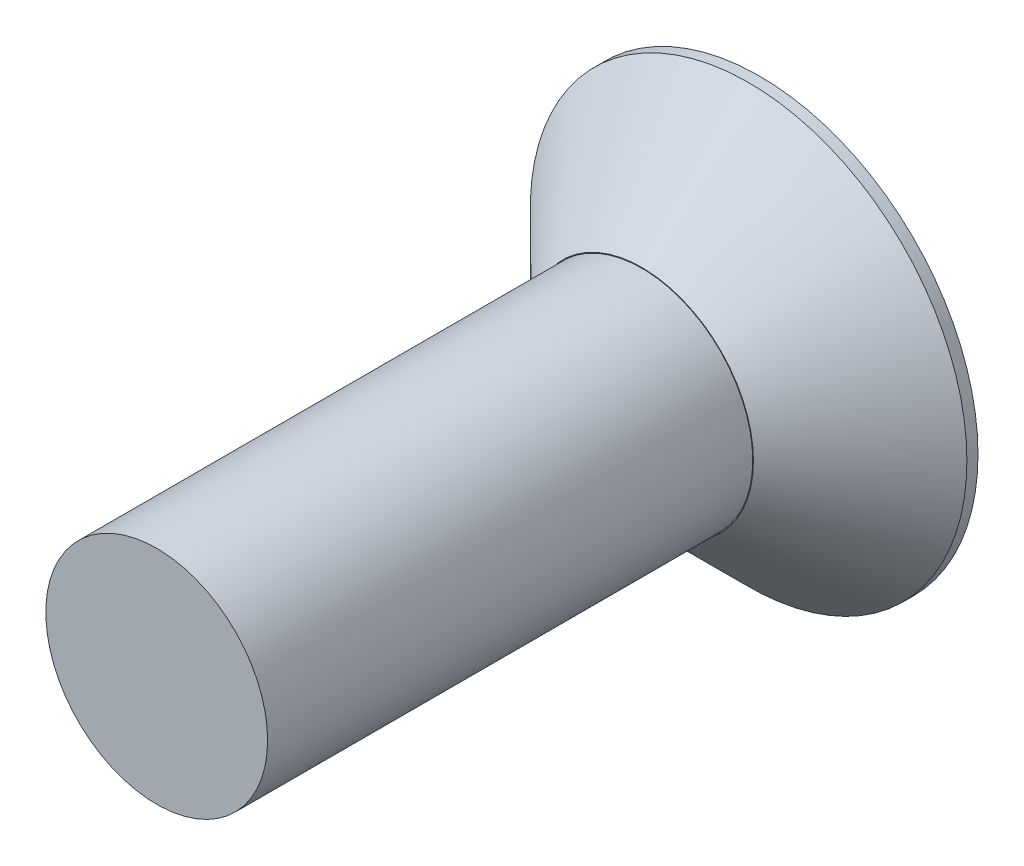
ISO-10303-21;
HEADER;
FILE_DESCRIPTION(('STEP AP214'),'2;1');
FILE_NAME('part.step','',(''),(''),'','','');
FILE_SCHEMA(('AUTOMOTIVE_DESIGN { 1 0 10303 214 1 1 1 1 }'));
ENDSEC;
DATA;
#1=APPLICATION_CONTEXT('core data for automotive mechanical design processes');
#2=APPLICATION_PROTOCOL_DEFINITION('international standard','automotive_design',2000,#1);
#3=PRODUCT_CONTEXT('',#1,'mechanical');
#4=PRODUCT('Part','Part','',(#3));
#5=PRODUCT_RELATED_PRODUCT_CATEGORY('part','',(#4));
#6=PRODUCT_DEFINITION_FORMATION('','',#4);
#7=PRODUCT_DEFINITION_CONTEXT('part definition',#1,'design');
#8=PRODUCT_DEFINITION('design','',#6,#7);
#9=PRODUCT_DEFINITION_SHAPE('','',#8);
#10=(LENGTH_UNIT() NAMED_UNIT(*) SI_UNIT(.MILLI.,.METRE.));
#11=(NAMED_UNIT(*) PLANE_ANGLE_UNIT() SI_UNIT($,.RADIAN.));
#12=(NAMED_UNIT(*) SI_UNIT($,.STERADIAN.) SOLID_ANGLE_UNIT());
#13=UNCERTAINTY_MEASURE_WITH_UNIT(LENGTH_MEASURE(1.E-05),#10,'distance_accuracy_value','');
#14=(GEOMETRIC_REPRESENTATION_CONTEXT(3) GLOBAL_UNCERTAINTY_ASSIGNED_CONTEXT((#13)) GLOBAL_UNIT_ASSIGNED_CONTEXT((#10,
#11,#12)) REPRESENTATION_CONTEXT('',''));
#15=CARTESIAN_POINT('',(0.,0.,0.));
#16=DIRECTION('',(0.,0.,1.));
#17=DIRECTION('',(1.,0.,0.));
#18=AXIS2_PLACEMENT_3D('',#15,#16,#17);
#19=CARTESIAN_POINT('',(-2.54,0.254,1.016));
#20=DIRECTION('',(0.,1.,0.));
#21=DIRECTION('',(-1.,0.,0.));
#22=AXIS2_PLACEMENT_3D('',#19,#20,#21);
#23=PLANE('',#22);
#24=DIRECTION('',(1.,0.,0.));
#25=VECTOR('',#24,1.);
#26=CARTESIAN_POINT('',(-2.54,0.254,1.016));
#27=LINE('',#26,#25);
#28=CARTESIAN_POINT('',(0.254,0.254,1.016));
#29=VERTEX_POINT('',#28);
#30=CARTESIAN_POINT('',(2.54,0.254,1.016));
#31=VERTEX_POINT('',#30);
#32=EDGE_CURVE('E188',#29,#31,#27,.T.);
#33=ORIENTED_EDGE('',*,*,#32,.F.);
#34=DIRECTION('',(0.,0.,-1.));
#35=VECTOR('',#34,1.);
#36=CARTESIAN_POINT('',(0.254000000000001,0.254,1.016));
#37=LINE('',#36,#35);
#38=CARTESIAN_POINT('',(0.254000000000001,0.254,0.));
#39=VERTEX_POINT('',#38);
#40=EDGE_CURVE('E174',#29,#39,#37,.T.);
#41=ORIENTED_EDGE('',*,*,#40,.T.);
#42=DIRECTION('',(1.,0.,0.));
#43=VECTOR('',#42,1.);
#44=CARTESIAN_POINT('',(-2.54,0.254,0.));
#45=LINE('',#44,#43);
#46=CARTESIAN_POINT('',(2.54,0.254,0.));
#47=VERTEX_POINT('',#46);
#48=EDGE_CURVE('E200',#39,#47,#45,.T.);
#49=ORIENTED_EDGE('',*,*,#48,.T.);
#50=DIRECTION('',(0.,0.,-1.));
#51=VECTOR('',#50,1.);
#52=CARTESIAN_POINT('',(2.54,0.254,1.016));
#53=LINE('',#52,#51);
#54=EDGE_CURVE('E203',#31,#47,#53,.T.);
#55=ORIENTED_EDGE('',*,*,#54,.F.);
#56=EDGE_LOOP('',(#33,#41,#49,#55));
#57=FACE_BOUND('',#56,.T.);
#58=ADVANCED_FACE('F35',(#57),#23,.F.);
#59=CARTESIAN_POINT('',(-2.54,-0.254,1.016));
#60=DIRECTION('',(0.,-1.,0.));
#61=DIRECTION('',(1.,0.,0.));
#62=AXIS2_PLACEMENT_3D('',#59,#60,#61);
#63=PLANE('',#62);
#64=DIRECTION('',(-1.,0.,0.));
#65=VECTOR('',#64,1.);
#66=CARTESIAN_POINT('',(-2.54,-0.254,0.));
#67=LINE('',#66,#65);
#68=CARTESIAN_POINT('',(2.54,-0.254,0.));
#69=VERTEX_POINT('',#68);
#70=CARTESIAN_POINT('',(0.253999999999999,-0.254,0.));
#71=VERTEX_POINT('',#70);
#72=EDGE_CURVE('E194',#69,#71,#67,.T.);
#73=ORIENTED_EDGE('',*,*,#72,.T.);
#74=DIRECTION('',(0.,0.,1.));
#75=VECTOR('',#74,1.);
#76=CARTESIAN_POINT('',(0.253999999999999,-0.254,1.016));
#77=LINE('',#76,#75);
#78=CARTESIAN_POINT('',(0.253999999999999,-0.254,1.016));
#79=VERTEX_POINT('',#78);
#80=EDGE_CURVE('E171',#71,#79,#77,.T.);
#81=ORIENTED_EDGE('',*,*,#80,.T.);
#82=DIRECTION('',(-1.,0.,0.));
#83=VECTOR('',#82,1.);
#84=CARTESIAN_POINT('',(-2.54,-0.254,1.016));
#85=LINE('',#84,#83);
#86=CARTESIAN_POINT('',(2.54,-0.254,1.016));
#87=VERTEX_POINT('',#86);
#88=EDGE_CURVE('E183',#87,#79,#85,.T.);
#89=ORIENTED_EDGE('',*,*,#88,.F.);
#90=DIRECTION('',(0.,0.,-1.));
#91=VECTOR('',#90,1.);
#92=CARTESIAN_POINT('',(2.54,-0.254,1.016));
#93=LINE('',#92,#91);
#94=EDGE_CURVE('E191',#87,#69,#93,.T.);
#95=ORIENTED_EDGE('',*,*,#94,.T.);
#96=EDGE_LOOP('',(#73,#81,#89,#95));
#97=FACE_BOUND('',#96,.T.);
#98=ADVANCED_FACE('F238',(#97),#63,.F.);
#99=CARTESIAN_POINT('',(0.,0.,2.159));
#100=DIRECTION('',(0.,0.,1.));
#101=DIRECTION('',(1.,0.,0.));
#102=AXIS2_PLACEMENT_3D('',#99,#100,#101);
#103=PLANE('',#102);
#104=CARTESIAN_POINT('',(0.,0.,2.159));
#105=DIRECTION('',(0.,0.,1.));
#106=DIRECTION('',(1.,0.,0.));
#107=AXIS2_PLACEMENT_3D('',#104,#105,#106);
#108=CIRCLE('',#107,2.0447);
#109=CARTESIAN_POINT('',(2.0447,0.,2.159));
#110=VERTEX_POINT('',#109);
#111=EDGE_CURVE('E43',#110,#110,#108,.T.);
#112=ORIENTED_EDGE('',*,*,#111,.T.);
#113=EDGE_LOOP('',(#112));
#114=FACE_BOUND('',#113,.T.);
#115=CARTESIAN_POINT('',(0.,0.,2.159));
#116=DIRECTION('',(0.,0.,1.));
#117=DIRECTION('',(1.,0.,0.));
#118=AXIS2_PLACEMENT_3D('',#115,#116,#117);
#119=CIRCLE('',#118,2.032);
#120=CARTESIAN_POINT('',(2.032,0.,2.159));
#121=VERTEX_POINT('',#120);
#122=EDGE_CURVE('E206',#121,#121,#119,.T.);
#123=ORIENTED_EDGE('',*,*,#122,.F.);
#124=EDGE_LOOP('',(#123));
#125=FACE_BOUND('',#124,.T.);
#126=ADVANCED_FACE('F224',(#114,#125),#103,.T.);
#127=CARTESIAN_POINT('',(0.,0.,2.159));
#128=DIRECTION('',(0.,0.,-1.));
#129=DIRECTION('',(-1.,0.,0.));
#130=AXIS2_PLACEMENT_3D('',#127,#128,#129);
#131=CYLINDRICAL_SURFACE('',#130,4.0005);
#132=CARTESIAN_POINT('',(0.,0.,0.203199999999997));
#133=DIRECTION('',(0.,0.,1.));
#134=DIRECTION('',(1.,0.,0.));
#135=AXIS2_PLACEMENT_3D('',#132,#133,#134);
#136=CIRCLE('',#135,4.0005);
#137=CARTESIAN_POINT('',(4.0005,0.,0.203199999999997));
#138=VERTEX_POINT('',#137);
#139=EDGE_CURVE('E11',#138,#138,#136,.F.);
#140=ORIENTED_EDGE('',*,*,#139,.T.);
#141=EDGE_LOOP('',(#140));
#142=FACE_BOUND('',#141,.T.);
#143=CARTESIAN_POINT('',(0.,0.,0.));
#144=DIRECTION('',(0.,0.,1.));
#145=DIRECTION('',(1.,0.,0.));
#146=AXIS2_PLACEMENT_3D('',#143,#144,#145);
#147=CIRCLE('',#146,4.0005);
#148=CARTESIAN_POINT('',(4.0005,0.,0.));
#149=VERTEX_POINT('',#148);
#150=EDGE_CURVE('E217',#149,#149,#147,.T.);
#151=ORIENTED_EDGE('',*,*,#150,.T.);
#152=EDGE_LOOP('',(#151));
#153=FACE_BOUND('',#152,.T.);
#154=ADVANCED_FACE('F304',(#142,#153),#131,.T.);
#155=CARTESIAN_POINT('',(0.,0.,0.));
#156=DIRECTION('',(0.,0.,1.));
#157=DIRECTION('',(1.,0.,0.));
#158=AXIS2_PLACEMENT_3D('',#155,#156,#157);
#159=PLANE('',#158);
#160=ORIENTED_EDGE('',*,*,#48,.F.);
#161=DIRECTION('',(0.,-1.,0.));
#162=VECTOR('',#161,1.);
#163=CARTESIAN_POINT('',(0.254000000000009,2.54,0.));
#164=LINE('',#163,#162);
#165=CARTESIAN_POINT('',(0.254000000000009,2.54,0.));
#166=VERTEX_POINT('',#165);
#167=EDGE_CURVE('E147',#166,#39,#164,.T.);
#168=ORIENTED_EDGE('',*,*,#167,.F.);
#169=DIRECTION('',(1.,0.,0.));
#170=VECTOR('',#169,1.);
#171=CARTESIAN_POINT('',(0.254000000000009,2.54,0.));
#172=LINE('',#171,#170);
#173=CARTESIAN_POINT('',(-0.253999999999991,2.54,0.));
#174=VERTEX_POINT('',#173);
#175=EDGE_CURVE('E158',#174,#166,#172,.T.);
#176=ORIENTED_EDGE('',*,*,#175,.F.);
#177=DIRECTION('',(0.,1.,0.));
#178=VECTOR('',#177,1.);
#179=CARTESIAN_POINT('',(-0.253999999999991,2.54,0.));
#180=LINE('',#179,#178);
#181=CARTESIAN_POINT('',(-0.253999999999999,0.254,0.));
#182=VERTEX_POINT('',#181);
#183=EDGE_CURVE('E155',#182,#174,#180,.T.);
#184=ORIENTED_EDGE('',*,*,#183,.F.);
#185=CARTESIAN_POINT('',(-2.54,0.254,0.));
#186=VERTEX_POINT('',#185);
#187=EDGE_CURVE('E182',#186,#182,#45,.T.);
#188=ORIENTED_EDGE('',*,*,#187,.F.);
#189=DIRECTION('',(0.,1.,0.));
#190=VECTOR('',#189,1.);
#191=CARTESIAN_POINT('',(-2.54,0.254,0.));
#192=LINE('',#191,#190);
#193=CARTESIAN_POINT('',(-2.54,-0.254,0.));
#194=VERTEX_POINT('',#193);
#195=EDGE_CURVE('E197',#194,#186,#192,.T.);
#196=ORIENTED_EDGE('',*,*,#195,.F.);
#197=CARTESIAN_POINT('',(-0.254000000000001,-0.254,0.));
#198=VERTEX_POINT('',#197);
#199=EDGE_CURVE('E193',#198,#194,#67,.T.);
#200=ORIENTED_EDGE('',*,*,#199,.F.);
#201=CARTESIAN_POINT('',(-0.254000000000009,-2.54,0.));
#202=VERTEX_POINT('',#201);
#203=EDGE_CURVE('E156',#202,#198,#180,.T.);
#204=ORIENTED_EDGE('',*,*,#203,.F.);
#205=DIRECTION('',(-1.,0.,0.));
#206=VECTOR('',#205,1.);
#207=CARTESIAN_POINT('',(0.253999999999991,-2.54,0.));
#208=LINE('',#207,#206);
#209=CARTESIAN_POINT('',(0.253999999999991,-2.54,0.));
#210=VERTEX_POINT('',#209);
#211=EDGE_CURVE('E130',#210,#202,#208,.T.);
#212=ORIENTED_EDGE('',*,*,#211,.F.);
#213=EDGE_CURVE('E149',#71,#210,#164,.T.);
#214=ORIENTED_EDGE('',*,*,#213,.F.);
#215=ORIENTED_EDGE('',*,*,#72,.F.);
#216=DIRECTION('',(0.,-1.,0.));
#217=VECTOR('',#216,1.);
#218=CARTESIAN_POINT('',(2.54,0.254,0.));
#219=LINE('',#218,#217);
#220=EDGE_CURVE('E177',#47,#69,#219,.T.);
#221=ORIENTED_EDGE('',*,*,#220,.F.);
#222=EDGE_LOOP('',(#160,#168,#176,#184,#188,#196,#200,#204,#212,#214,#215,#221));
#223=FACE_BOUND('',#222,.T.);
#224=ORIENTED_EDGE('',*,*,#150,.F.);
#225=EDGE_LOOP('',(#224));
#226=FACE_BOUND('',#225,.T.);
#227=ADVANCED_FACE('F269',(#223,#226),#159,.F.);
#228=CARTESIAN_POINT('',(0.,0.,11.049));
#229=DIRECTION('',(0.,0.,-1.));
#230=DIRECTION('',(-1.,0.,0.));
#231=AXIS2_PLACEMENT_3D('',#228,#229,#230);
#232=CYLINDRICAL_SURFACE('',#231,2.032);
#233=CARTESIAN_POINT('',(0.,0.,11.049));
#234=DIRECTION('',(0.,0.,1.));
#235=DIRECTION('',(1.,0.,0.));
#236=AXIS2_PLACEMENT_3D('',#233,#234,#235);
#237=CIRCLE('',#236,2.032);
#238=CARTESIAN_POINT('',(2.032,0.,11.049));
#239=VERTEX_POINT('',#238);
#240=EDGE_CURVE('E214',#239,#239,#237,.T.);
#241=ORIENTED_EDGE('',*,*,#240,.F.);
#242=EDGE_LOOP('',(#241));
#243=FACE_BOUND('',#242,.T.);
#244=ORIENTED_EDGE('',*,*,#122,.T.);
#245=EDGE_LOOP('',(#244));
#246=FACE_BOUND('',#245,.T.);
#247=ADVANCED_FACE('F297',(#243,#246),#232,.T.);
#248=CARTESIAN_POINT('',(0.,0.,11.049));
#249=DIRECTION('',(0.,0.,1.));
#250=DIRECTION('',(1.,0.,0.));
#251=AXIS2_PLACEMENT_3D('',#248,#249,#250);
#252=PLANE('',#251);
#253=ORIENTED_EDGE('',*,*,#240,.T.);
#254=EDGE_LOOP('',(#253));
#255=FACE_BOUND('',#254,.T.);
#256=ADVANCED_FACE('F260',(#255),#252,.T.);
#257=CARTESIAN_POINT('',(2.54,0.254,1.016));
#258=DIRECTION('',(1.,0.,0.));
#259=DIRECTION('',(0.,0.,-1.));
#260=AXIS2_PLACEMENT_3D('',#257,#258,#259);
#261=PLANE('',#260);
#262=ORIENTED_EDGE('',*,*,#220,.T.);
#263=ORIENTED_EDGE('',*,*,#94,.F.);
#264=DIRECTION('',(0.,-1.,0.));
#265=VECTOR('',#264,1.);
#266=CARTESIAN_POINT('',(2.54,0.254,1.016));
#267=LINE('',#266,#265);
#268=EDGE_CURVE('E178',#31,#87,#267,.T.);
#269=ORIENTED_EDGE('',*,*,#268,.F.);
#270=ORIENTED_EDGE('',*,*,#54,.T.);
#271=EDGE_LOOP('',(#262,#263,#269,#270));
#272=FACE_BOUND('',#271,.T.);
#273=ADVANCED_FACE('F253',(#272),#261,.F.);
#274=ORIENTED_EDGE('',*,*,#187,.T.);
#275=DIRECTION('',(0.,0.,1.));
#276=VECTOR('',#275,1.);
#277=CARTESIAN_POINT('',(-0.253999999999999,0.254,1.016));
#278=LINE('',#277,#276);
#279=CARTESIAN_POINT('',(-0.253999999999999,0.254,1.016));
#280=VERTEX_POINT('',#279);
#281=EDGE_CURVE('E168',#182,#280,#278,.T.);
#282=ORIENTED_EDGE('',*,*,#281,.T.);
#283=CARTESIAN_POINT('',(-2.54,0.254,1.016));
#284=VERTEX_POINT('',#283);
#285=EDGE_CURVE('E189',#284,#280,#27,.T.);
#286=ORIENTED_EDGE('',*,*,#285,.F.);
#287=DIRECTION('',(0.,0.,-1.));
#288=VECTOR('',#287,1.);
#289=CARTESIAN_POINT('',(-2.54,0.254,1.016));
#290=LINE('',#289,#288);
#291=EDGE_CURVE('E207',#284,#186,#290,.T.);
#292=ORIENTED_EDGE('',*,*,#291,.T.);
#293=EDGE_LOOP('',(#274,#282,#286,#292));
#294=FACE_BOUND('',#293,.T.);
#295=ADVANCED_FACE('F241',(#294),#23,.F.);
#296=CARTESIAN_POINT('',(-2.54,0.254,1.016));
#297=DIRECTION('',(-1.,0.,0.));
#298=DIRECTION('',(0.,0.,1.));
#299=AXIS2_PLACEMENT_3D('',#296,#297,#298);
#300=PLANE('',#299);
#301=ORIENTED_EDGE('',*,*,#195,.T.);
#302=ORIENTED_EDGE('',*,*,#291,.F.);
#303=DIRECTION('',(0.,1.,0.));
#304=VECTOR('',#303,1.);
#305=CARTESIAN_POINT('',(-2.54,0.254,1.016));
#306=LINE('',#305,#304);
#307=CARTESIAN_POINT('',(-2.54,-0.254,1.016));
#308=VERTEX_POINT('',#307);
#309=EDGE_CURVE('E185',#308,#284,#306,.T.);
#310=ORIENTED_EDGE('',*,*,#309,.F.);
#311=DIRECTION('',(0.,0.,-1.));
#312=VECTOR('',#311,1.);
#313=CARTESIAN_POINT('',(-2.54,-0.254,1.016));
#314=LINE('',#313,#312);
#315=EDGE_CURVE('E209',#308,#194,#314,.T.);
#316=ORIENTED_EDGE('',*,*,#315,.T.);
#317=EDGE_LOOP('',(#301,#302,#310,#316));
#318=FACE_BOUND('',#317,.T.);
#319=ADVANCED_FACE('F252',(#318),#300,.F.);
#320=CARTESIAN_POINT('',(-0.254,-0.254,1.016));
#321=VERTEX_POINT('',#320);
#322=EDGE_CURVE('E181',#321,#308,#85,.T.);
#323=ORIENTED_EDGE('',*,*,#322,.F.);
#324=DIRECTION('',(0.,0.,-1.));
#325=VECTOR('',#324,1.);
#326=CARTESIAN_POINT('',(-0.254000000000001,-0.254,1.016));
#327=LINE('',#326,#325);
#328=EDGE_CURVE('E137',#321,#198,#327,.T.);
#329=ORIENTED_EDGE('',*,*,#328,.T.);
#330=ORIENTED_EDGE('',*,*,#199,.T.);
#331=ORIENTED_EDGE('',*,*,#315,.F.);
#332=EDGE_LOOP('',(#323,#329,#330,#331));
#333=FACE_BOUND('',#332,.T.);
#334=ADVANCED_FACE('F247',(#333),#63,.F.);
#335=CARTESIAN_POINT('',(2.54,-0.254,1.016));
#336=DIRECTION('',(0.,0.,1.));
#337=DIRECTION('',(1.,0.,0.));
#338=AXIS2_PLACEMENT_3D('',#335,#336,#337);
#339=PLANE('',#338);
#340=ORIENTED_EDGE('',*,*,#285,.T.);
#341=DIRECTION('',(0.,1.,0.));
#342=VECTOR('',#341,1.);
#343=CARTESIAN_POINT('',(-0.253999999999991,2.54,1.016));
#344=LINE('',#343,#342);
#345=CARTESIAN_POINT('',(-0.253999999999991,2.54,1.016));
#346=VERTEX_POINT('',#345);
#347=EDGE_CURVE('E140',#280,#346,#344,.T.);
#348=ORIENTED_EDGE('',*,*,#347,.T.);
#349=DIRECTION('',(1.,0.,0.));
#350=VECTOR('',#349,1.);
#351=CARTESIAN_POINT('',(0.254000000000009,2.54,1.016));
#352=LINE('',#351,#350);
#353=CARTESIAN_POINT('',(0.254000000000009,2.54,1.016));
#354=VERTEX_POINT('',#353);
#355=EDGE_CURVE('E139',#346,#354,#352,.T.);
#356=ORIENTED_EDGE('',*,*,#355,.T.);
#357=DIRECTION('',(0.,-1.,0.));
#358=VECTOR('',#357,1.);
#359=CARTESIAN_POINT('',(0.254000000000009,2.54,1.016));
#360=LINE('',#359,#358);
#361=EDGE_CURVE('E50',#354,#29,#360,.T.);
#362=ORIENTED_EDGE('',*,*,#361,.T.);
#363=ORIENTED_EDGE('',*,*,#32,.T.);
#364=ORIENTED_EDGE('',*,*,#268,.T.);
#365=ORIENTED_EDGE('',*,*,#88,.T.);
#366=CARTESIAN_POINT('',(0.253999999999991,-2.54,1.016));
#367=VERTEX_POINT('',#366);
#368=EDGE_CURVE('E145',#79,#367,#360,.T.);
#369=ORIENTED_EDGE('',*,*,#368,.T.);
#370=DIRECTION('',(-1.,0.,0.));
#371=VECTOR('',#370,1.);
#372=CARTESIAN_POINT('',(0.253999999999991,-2.54,1.016));
#373=LINE('',#372,#371);
#374=CARTESIAN_POINT('',(-0.254000000000009,-2.54,1.016));
#375=VERTEX_POINT('',#374);
#376=EDGE_CURVE('E128',#367,#375,#373,.T.);
#377=ORIENTED_EDGE('',*,*,#376,.T.);
#378=EDGE_CURVE('E57',#375,#321,#344,.T.);
#379=ORIENTED_EDGE('',*,*,#378,.T.);
#380=ORIENTED_EDGE('',*,*,#322,.T.);
#381=ORIENTED_EDGE('',*,*,#309,.T.);
#382=EDGE_LOOP('',(#340,#348,#356,#362,#363,#364,#365,#369,#377,#379,#380,#381));
#383=FACE_BOUND('',#382,.T.);
#384=ADVANCED_FACE('F143',(#383),#339,.F.);
#385=CARTESIAN_POINT('',(-0.253999999999991,2.54,1.016));
#386=DIRECTION('',(-1.,0.,0.));
#387=DIRECTION('',(0.,-1.,0.));
#388=AXIS2_PLACEMENT_3D('',#385,#386,#387);
#389=PLANE('',#388);
#390=ORIENTED_EDGE('',*,*,#378,.F.);
#391=DIRECTION('',(0.,0.,-1.));
#392=VECTOR('',#391,1.);
#393=CARTESIAN_POINT('',(-0.254000000000009,-2.54,1.016));
#394=LINE('',#393,#392);
#395=EDGE_CURVE('E125',#375,#202,#394,.T.);
#396=ORIENTED_EDGE('',*,*,#395,.T.);
#397=ORIENTED_EDGE('',*,*,#203,.T.);
#398=ORIENTED_EDGE('',*,*,#328,.F.);
#399=EDGE_LOOP('',(#390,#396,#397,#398));
#400=FACE_BOUND('',#399,.T.);
#401=ADVANCED_FACE('F135',(#400),#389,.F.);
#402=CARTESIAN_POINT('',(0.254000000000009,2.54,1.016));
#403=DIRECTION('',(1.,0.,0.));
#404=DIRECTION('',(0.,1.,0.));
#405=AXIS2_PLACEMENT_3D('',#402,#403,#404);
#406=PLANE('',#405);
#407=ORIENTED_EDGE('',*,*,#213,.T.);
#408=DIRECTION('',(0.,0.,-1.));
#409=VECTOR('',#408,1.);
#410=CARTESIAN_POINT('',(0.253999999999991,-2.54,1.016));
#411=LINE('',#410,#409);
#412=EDGE_CURVE('E161',#367,#210,#411,.T.);
#413=ORIENTED_EDGE('',*,*,#412,.F.);
#414=ORIENTED_EDGE('',*,*,#368,.F.);
#415=ORIENTED_EDGE('',*,*,#80,.F.);
#416=EDGE_LOOP('',(#407,#413,#414,#415));
#417=FACE_BOUND('',#416,.T.);
#418=ADVANCED_FACE('F286',(#417),#406,.F.);
#419=CARTESIAN_POINT('',(0.253999999999991,-2.54,1.016));
#420=DIRECTION('',(0.,-1.,0.));
#421=DIRECTION('',(1.,0.,0.));
#422=AXIS2_PLACEMENT_3D('',#419,#420,#421);
#423=PLANE('',#422);
#424=ORIENTED_EDGE('',*,*,#211,.T.);
#425=ORIENTED_EDGE('',*,*,#395,.F.);
#426=ORIENTED_EDGE('',*,*,#376,.F.);
#427=ORIENTED_EDGE('',*,*,#412,.T.);
#428=EDGE_LOOP('',(#424,#425,#426,#427));
#429=FACE_BOUND('',#428,.T.);
#430=ADVANCED_FACE('F126',(#429),#423,.F.);
#431=ORIENTED_EDGE('',*,*,#361,.F.);
#432=DIRECTION('',(0.,0.,-1.));
#433=VECTOR('',#432,1.);
#434=CARTESIAN_POINT('',(0.254000000000009,2.54,1.016));
#435=LINE('',#434,#433);
#436=EDGE_CURVE('E163',#354,#166,#435,.T.);
#437=ORIENTED_EDGE('',*,*,#436,.T.);
#438=ORIENTED_EDGE('',*,*,#167,.T.);
#439=ORIENTED_EDGE('',*,*,#40,.F.);
#440=EDGE_LOOP('',(#431,#437,#438,#439));
#441=FACE_BOUND('',#440,.T.);
#442=ADVANCED_FACE('F278',(#441),#406,.F.);
#443=ORIENTED_EDGE('',*,*,#183,.T.);
#444=DIRECTION('',(0.,0.,-1.));
#445=VECTOR('',#444,1.);
#446=CARTESIAN_POINT('',(-0.253999999999991,2.54,1.016));
#447=LINE('',#446,#445);
#448=EDGE_CURVE('E133',#346,#174,#447,.T.);
#449=ORIENTED_EDGE('',*,*,#448,.F.);
#450=ORIENTED_EDGE('',*,*,#347,.F.);
#451=ORIENTED_EDGE('',*,*,#281,.F.);
#452=EDGE_LOOP('',(#443,#449,#450,#451));
#453=FACE_BOUND('',#452,.T.);
#454=ADVANCED_FACE('F233',(#453),#389,.F.);
#455=CARTESIAN_POINT('',(0.254000000000009,2.54,1.016));
#456=DIRECTION('',(0.,1.,0.));
#457=DIRECTION('',(-1.,0.,0.));
#458=AXIS2_PLACEMENT_3D('',#455,#456,#457);
#459=PLANE('',#458);
#460=ORIENTED_EDGE('',*,*,#175,.T.);
#461=ORIENTED_EDGE('',*,*,#436,.F.);
#462=ORIENTED_EDGE('',*,*,#355,.F.);
#463=ORIENTED_EDGE('',*,*,#448,.T.);
#464=EDGE_LOOP('',(#460,#461,#462,#463));
#465=FACE_BOUND('',#464,.T.);
#466=ADVANCED_FACE('F228',(#465),#459,.F.);
#467=CARTESIAN_POINT('',(0.,0.,2.159));
#468=DIRECTION('',(0.,0.,-1.));
#469=DIRECTION('',(-1.,0.,0.));
#470=AXIS2_PLACEMENT_3D('',#467,#468,#469);
#471=CONICAL_SURFACE('',#470,2.0447,0.785398163397447);
#472=ORIENTED_EDGE('',*,*,#139,.F.);
#473=EDGE_LOOP('',(#472));
#474=FACE_BOUND('',#473,.T.);
#475=ORIENTED_EDGE('',*,*,#111,.F.);
#476=EDGE_LOOP('',(#475));
#477=FACE_BOUND('',#476,.T.);
#478=ADVANCED_FACE('F37',(#474,#477),#471,.T.);
#479=CLOSED_SHELL('',(#58,#98,#126,#154,#227,#247,#256,#273,#295,#319,#334,#384,#401,#418,#430,
#442,#454,#466,#478));
#480=MANIFOLD_SOLID_BREP('B2',#479);
#481=ADVANCED_BREP_SHAPE_REPRESENTATION('',(#18,#480),#14);
#482=SHAPE_DEFINITION_REPRESENTATION(#9,#481);
ENDSEC;
END-ISO-10303-21;
